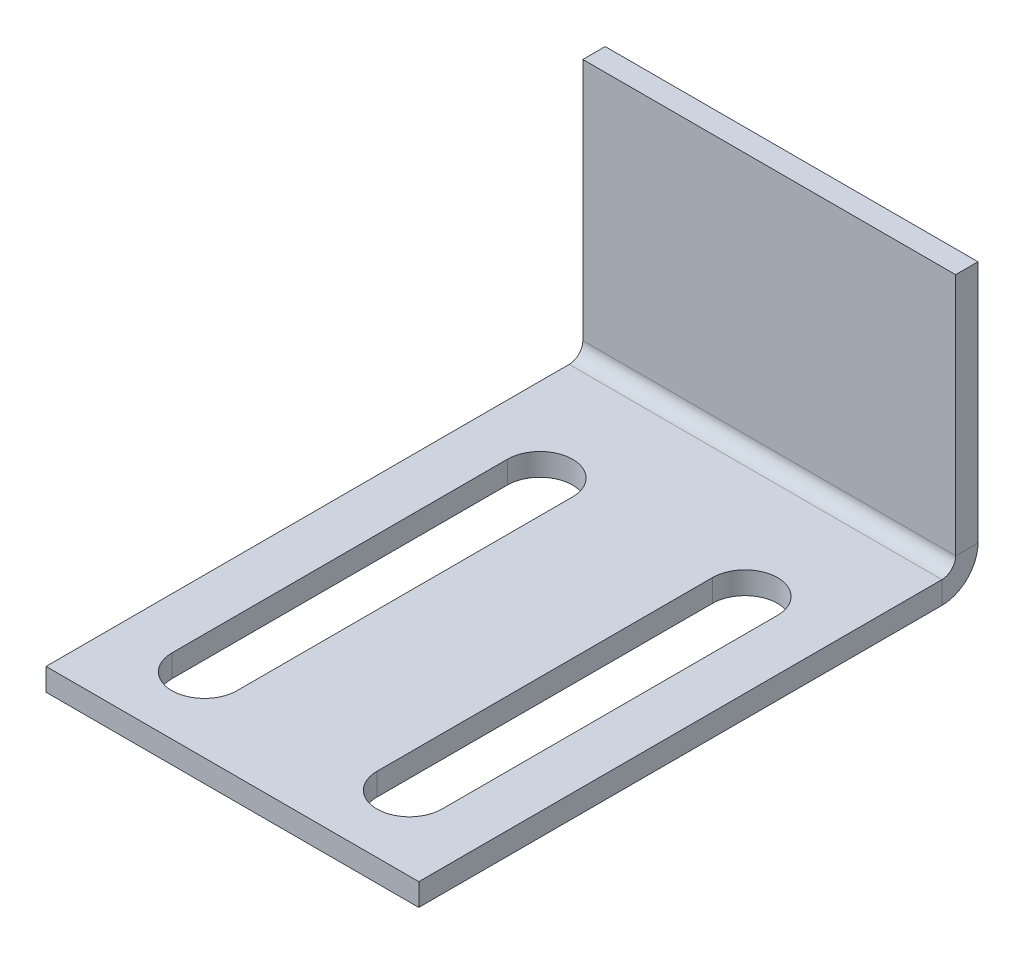
ISO-10303-21;
HEADER;
FILE_DESCRIPTION(('STEP AP214'),'2;1');
FILE_NAME('part.step','',(''),(''),'','','');
FILE_SCHEMA(('AUTOMOTIVE_DESIGN { 1 0 10303 214 1 1 1 1 }'));
ENDSEC;
DATA;
#1=APPLICATION_CONTEXT('core data for automotive mechanical design processes');
#2=APPLICATION_PROTOCOL_DEFINITION('international standard','automotive_design',2000,#1);
#3=PRODUCT_CONTEXT('',#1,'mechanical');
#4=PRODUCT('Part','Part','',(#3));
#5=PRODUCT_RELATED_PRODUCT_CATEGORY('part','',(#4));
#6=PRODUCT_DEFINITION_FORMATION('','',#4);
#7=PRODUCT_DEFINITION_CONTEXT('part definition',#1,'design');
#8=PRODUCT_DEFINITION('design','',#6,#7);
#9=PRODUCT_DEFINITION_SHAPE('','',#8);
#10=(LENGTH_UNIT() NAMED_UNIT(*) SI_UNIT(.MILLI.,.METRE.));
#11=(NAMED_UNIT(*) PLANE_ANGLE_UNIT() SI_UNIT($,.RADIAN.));
#12=(NAMED_UNIT(*) SI_UNIT($,.STERADIAN.) SOLID_ANGLE_UNIT());
#13=UNCERTAINTY_MEASURE_WITH_UNIT(LENGTH_MEASURE(1.E-05),#10,'distance_accuracy_value','');
#14=(GEOMETRIC_REPRESENTATION_CONTEXT(3) GLOBAL_UNCERTAINTY_ASSIGNED_CONTEXT((#13)) GLOBAL_UNIT_ASSIGNED_CONTEXT((#10,
#11,#12)) REPRESENTATION_CONTEXT('',''));
#15=CARTESIAN_POINT('',(0.,0.,0.));
#16=DIRECTION('',(0.,0.,1.));
#17=DIRECTION('',(1.,0.,0.));
#18=AXIS2_PLACEMENT_3D('',#15,#16,#17);
#19=CARTESIAN_POINT('',(20.,0.,-1.2));
#20=DIRECTION('',(1.,0.,0.));
#21=DIRECTION('',(0.,0.,-1.));
#22=AXIS2_PLACEMENT_3D('',#19,#20,#21);
#23=PLANE('',#22);
#24=DIRECTION('',(0.,1.,0.));
#25=VECTOR('',#24,1.);
#26=CARTESIAN_POINT('',(20.,0.,0.));
#27=LINE('',#26,#25);
#28=CARTESIAN_POINT('',(20.,1.9366,0.));
#29=VERTEX_POINT('',#28);
#30=CARTESIAN_POINT('',(20.,15.,0.));
#31=VERTEX_POINT('',#30);
#32=EDGE_CURVE('E302',#29,#31,#27,.T.);
#33=ORIENTED_EDGE('',*,*,#32,.F.);
#34=DIRECTION('',(0.,0.,-1.));
#35=VECTOR('',#34,1.);
#36=CARTESIAN_POINT('',(20.,1.9366,0.));
#37=LINE('',#36,#35);
#38=CARTESIAN_POINT('',(20.,1.9366,-1.2));
#39=VERTEX_POINT('',#38);
#40=EDGE_CURVE('E275',#29,#39,#37,.T.);
#41=ORIENTED_EDGE('',*,*,#40,.T.);
#42=DIRECTION('',(0.,1.,0.));
#43=VECTOR('',#42,1.);
#44=CARTESIAN_POINT('',(20.,0.,-1.2));
#45=LINE('',#44,#43);
#46=CARTESIAN_POINT('',(20.,15.,-1.2));
#47=VERTEX_POINT('',#46);
#48=EDGE_CURVE('E294',#39,#47,#45,.T.);
#49=ORIENTED_EDGE('',*,*,#48,.T.);
#50=DIRECTION('',(0.,0.,1.));
#51=VECTOR('',#50,1.);
#52=CARTESIAN_POINT('',(20.,15.,-1.2));
#53=LINE('',#52,#51);
#54=EDGE_CURVE('E62',#47,#31,#53,.T.);
#55=ORIENTED_EDGE('',*,*,#54,.T.);
#56=EDGE_LOOP('',(#33,#41,#49,#55));
#57=FACE_BOUND('',#56,.T.);
#58=ADVANCED_FACE('F58',(#57),#23,.T.);
#59=CARTESIAN_POINT('',(0.,0.,-1.2));
#60=DIRECTION('',(0.,0.,-1.));
#61=DIRECTION('',(-1.,0.,0.));
#62=AXIS2_PLACEMENT_3D('',#59,#60,#61);
#63=PLANE('',#62);
#64=ORIENTED_EDGE('',*,*,#48,.F.);
#65=DIRECTION('',(1.,0.,0.));
#66=VECTOR('',#65,1.);
#67=CARTESIAN_POINT('',(20.,1.93659999999999,-1.2));
#68=LINE('',#67,#66);
#69=CARTESIAN_POINT('',(0.,1.9366,-1.2));
#70=VERTEX_POINT('',#69);
#71=EDGE_CURVE('E268',#39,#70,#68,.F.);
#72=ORIENTED_EDGE('',*,*,#71,.T.);
#73=DIRECTION('',(0.,-1.,0.));
#74=VECTOR('',#73,1.);
#75=CARTESIAN_POINT('',(0.,0.,-1.2));
#76=LINE('',#75,#74);
#77=CARTESIAN_POINT('',(0.,15.,-1.2));
#78=VERTEX_POINT('',#77);
#79=EDGE_CURVE('E291',#78,#70,#76,.T.);
#80=ORIENTED_EDGE('',*,*,#79,.F.);
#81=DIRECTION('',(-1.,0.,0.));
#82=VECTOR('',#81,1.);
#83=CARTESIAN_POINT('',(0.,15.,-1.2));
#84=LINE('',#83,#82);
#85=EDGE_CURVE('E297',#47,#78,#84,.T.);
#86=ORIENTED_EDGE('',*,*,#85,.F.);
#87=EDGE_LOOP('',(#64,#72,#80,#86));
#88=FACE_BOUND('',#87,.T.);
#89=ADVANCED_FACE('F324',(#88),#63,.T.);
#90=CARTESIAN_POINT('',(0.,0.,0.));
#91=DIRECTION('',(0.,0.,-1.));
#92=DIRECTION('',(-1.,0.,0.));
#93=AXIS2_PLACEMENT_3D('',#90,#91,#92);
#94=PLANE('',#93);
#95=DIRECTION('',(1.,0.,0.));
#96=VECTOR('',#95,1.);
#97=CARTESIAN_POINT('',(20.,1.9366,0.));
#98=LINE('',#97,#96);
#99=CARTESIAN_POINT('',(0.,1.93659999999999,0.));
#100=VERTEX_POINT('',#99);
#101=EDGE_CURVE('E281',#29,#100,#98,.F.);
#102=ORIENTED_EDGE('',*,*,#101,.F.);
#103=ORIENTED_EDGE('',*,*,#32,.T.);
#104=DIRECTION('',(-1.,0.,0.));
#105=VECTOR('',#104,1.);
#106=CARTESIAN_POINT('',(0.,15.,0.));
#107=LINE('',#106,#105);
#108=CARTESIAN_POINT('',(0.,15.,0.));
#109=VERTEX_POINT('',#108);
#110=EDGE_CURVE('E295',#31,#109,#107,.T.);
#111=ORIENTED_EDGE('',*,*,#110,.T.);
#112=DIRECTION('',(0.,-1.,0.));
#113=VECTOR('',#112,1.);
#114=CARTESIAN_POINT('',(0.,0.,0.));
#115=LINE('',#114,#113);
#116=EDGE_CURVE('E288',#109,#100,#115,.T.);
#117=ORIENTED_EDGE('',*,*,#116,.T.);
#118=EDGE_LOOP('',(#102,#103,#111,#117));
#119=FACE_BOUND('',#118,.T.);
#120=ADVANCED_FACE('F308',(#119),#94,.F.);
#121=CARTESIAN_POINT('',(0.,0.,-1.2));
#122=DIRECTION('',(-1.,0.,0.));
#123=DIRECTION('',(0.,0.,1.));
#124=AXIS2_PLACEMENT_3D('',#121,#122,#123);
#125=PLANE('',#124);
#126=DIRECTION('',(0.,0.,-1.));
#127=VECTOR('',#126,1.);
#128=CARTESIAN_POINT('',(0.,1.93659999999999,0.));
#129=LINE('',#128,#127);
#130=EDGE_CURVE('E285',#100,#70,#129,.T.);
#131=ORIENTED_EDGE('',*,*,#130,.F.);
#132=ORIENTED_EDGE('',*,*,#116,.F.);
#133=DIRECTION('',(0.,0.,1.));
#134=VECTOR('',#133,1.);
#135=CARTESIAN_POINT('',(0.,15.,-1.2));
#136=LINE('',#135,#134);
#137=EDGE_CURVE('E13',#78,#109,#136,.T.);
#138=ORIENTED_EDGE('',*,*,#137,.F.);
#139=ORIENTED_EDGE('',*,*,#79,.T.);
#140=EDGE_LOOP('',(#131,#132,#138,#139));
#141=FACE_BOUND('',#140,.T.);
#142=ADVANCED_FACE('F60',(#141),#125,.T.);
#143=CARTESIAN_POINT('',(0.,15.,-1.2));
#144=DIRECTION('',(0.,1.,0.));
#145=DIRECTION('',(0.,0.,1.));
#146=AXIS2_PLACEMENT_3D('',#143,#144,#145);
#147=PLANE('',#146);
#148=ORIENTED_EDGE('',*,*,#110,.F.);
#149=ORIENTED_EDGE('',*,*,#54,.F.);
#150=ORIENTED_EDGE('',*,*,#85,.T.);
#151=ORIENTED_EDGE('',*,*,#137,.T.);
#152=EDGE_LOOP('',(#148,#149,#150,#151));
#153=FACE_BOUND('',#152,.T.);
#154=ADVANCED_FACE('F315',(#153),#147,.T.);
#155=CARTESIAN_POINT('',(0.,1.9366,0.7366));
#156=DIRECTION('',(-1.,0.,0.));
#157=DIRECTION('',(0.,-1.,0.));
#158=AXIS2_PLACEMENT_3D('',#155,#156,#157);
#159=PLANE('',#158);
#160=DIRECTION('',(0.,1.,0.));
#161=VECTOR('',#160,1.);
#162=CARTESIAN_POINT('',(0.,0.,0.736599999999993));
#163=LINE('',#162,#161);
#164=CARTESIAN_POINT('',(0.,1.2,0.736599999999997));
#165=VERTEX_POINT('',#164);
#166=CARTESIAN_POINT('',(0.,0.,0.736599999999993));
#167=VERTEX_POINT('',#166);
#168=EDGE_CURVE('E237',#165,#167,#163,.F.);
#169=ORIENTED_EDGE('',*,*,#168,.F.);
#170=CARTESIAN_POINT('',(0.,1.9366,0.7366));
#171=DIRECTION('',(1.,0.,0.));
#172=DIRECTION('',(0.,1.,0.));
#173=AXIS2_PLACEMENT_3D('',#170,#171,#172);
#174=CIRCLE('',#173,0.736599999999998);
#175=EDGE_CURVE('E278',#100,#165,#174,.F.);
#176=ORIENTED_EDGE('',*,*,#175,.F.);
#177=ORIENTED_EDGE('',*,*,#130,.T.);
#178=CARTESIAN_POINT('',(0.,1.9366,0.7366));
#179=DIRECTION('',(1.,0.,0.));
#180=DIRECTION('',(0.,1.,0.));
#181=AXIS2_PLACEMENT_3D('',#178,#179,#180);
#182=CIRCLE('',#181,1.9366);
#183=EDGE_CURVE('E271',#70,#167,#182,.F.);
#184=ORIENTED_EDGE('',*,*,#183,.T.);
#185=EDGE_LOOP('',(#169,#176,#177,#184));
#186=FACE_BOUND('',#185,.T.);
#187=ADVANCED_FACE('F321',(#186),#159,.T.);
#188=CARTESIAN_POINT('',(20.,1.9366,0.7366));
#189=DIRECTION('',(-1.,0.,0.));
#190=DIRECTION('',(0.,-1.,0.));
#191=AXIS2_PLACEMENT_3D('',#188,#189,#190);
#192=PLANE('',#191);
#193=CARTESIAN_POINT('',(20.,1.9366,0.7366));
#194=DIRECTION('',(1.,0.,0.));
#195=DIRECTION('',(0.,1.,0.));
#196=AXIS2_PLACEMENT_3D('',#193,#194,#195);
#197=CIRCLE('',#196,0.736599999999998);
#198=CARTESIAN_POINT('',(20.,1.2,0.736599999999997));
#199=VERTEX_POINT('',#198);
#200=EDGE_CURVE('E241',#199,#29,#197,.T.);
#201=ORIENTED_EDGE('',*,*,#200,.F.);
#202=DIRECTION('',(0.,1.,0.));
#203=VECTOR('',#202,1.);
#204=CARTESIAN_POINT('',(20.,1.2,0.736599999999997));
#205=LINE('',#204,#203);
#206=CARTESIAN_POINT('',(20.,0.,0.736599999999993));
#207=VERTEX_POINT('',#206);
#208=EDGE_CURVE('E261',#199,#207,#205,.F.);
#209=ORIENTED_EDGE('',*,*,#208,.T.);
#210=CARTESIAN_POINT('',(20.,1.9366,0.7366));
#211=DIRECTION('',(1.,0.,0.));
#212=DIRECTION('',(0.,1.,0.));
#213=AXIS2_PLACEMENT_3D('',#210,#211,#212);
#214=CIRCLE('',#213,1.9366);
#215=EDGE_CURVE('E272',#207,#39,#214,.T.);
#216=ORIENTED_EDGE('',*,*,#215,.T.);
#217=ORIENTED_EDGE('',*,*,#40,.F.);
#218=EDGE_LOOP('',(#201,#209,#216,#217));
#219=FACE_BOUND('',#218,.T.);
#220=ADVANCED_FACE('F329',(#219),#192,.F.);
#221=CARTESIAN_POINT('',(20.,1.9366,0.7366));
#222=DIRECTION('',(1.,0.,0.));
#223=DIRECTION('',(0.,-1.,0.));
#224=AXIS2_PLACEMENT_3D('',#221,#222,#223);
#225=CYLINDRICAL_SURFACE('',#224,1.9366);
#226=ORIENTED_EDGE('',*,*,#71,.F.);
#227=ORIENTED_EDGE('',*,*,#215,.F.);
#228=DIRECTION('',(1.,0.,0.));
#229=VECTOR('',#228,1.);
#230=CARTESIAN_POINT('',(0.,0.,0.736599999999993));
#231=LINE('',#230,#229);
#232=EDGE_CURVE('E259',#207,#167,#231,.F.);
#233=ORIENTED_EDGE('',*,*,#232,.T.);
#234=ORIENTED_EDGE('',*,*,#183,.F.);
#235=EDGE_LOOP('',(#226,#227,#233,#234));
#236=FACE_BOUND('',#235,.T.);
#237=ADVANCED_FACE('F326',(#236),#225,.T.);
#238=CARTESIAN_POINT('',(20.,1.9366,0.7366));
#239=DIRECTION('',(1.,0.,0.));
#240=DIRECTION('',(0.,-1.,0.));
#241=AXIS2_PLACEMENT_3D('',#238,#239,#240);
#242=CYLINDRICAL_SURFACE('',#241,0.736599999999998);
#243=ORIENTED_EDGE('',*,*,#101,.T.);
#244=ORIENTED_EDGE('',*,*,#175,.T.);
#245=DIRECTION('',(1.,0.,0.));
#246=VECTOR('',#245,1.);
#247=CARTESIAN_POINT('',(0.,1.2,0.736599999999997));
#248=LINE('',#247,#246);
#249=EDGE_CURVE('E264',#165,#199,#248,.T.);
#250=ORIENTED_EDGE('',*,*,#249,.T.);
#251=ORIENTED_EDGE('',*,*,#200,.T.);
#252=EDGE_LOOP('',(#243,#244,#250,#251));
#253=FACE_BOUND('',#252,.T.);
#254=ADVANCED_FACE('F347',(#253),#242,.F.);
#255=CARTESIAN_POINT('',(0.,0.,0.));
#256=DIRECTION('',(1.,0.,0.));
#257=DIRECTION('',(0.,0.,-1.));
#258=AXIS2_PLACEMENT_3D('',#255,#256,#257);
#259=PLANE('',#258);
#260=ORIENTED_EDGE('',*,*,#168,.T.);
#261=DIRECTION('',(0.,0.,-1.));
#262=VECTOR('',#261,1.);
#263=CARTESIAN_POINT('',(0.,0.,0.));
#264=LINE('',#263,#262);
#265=CARTESIAN_POINT('',(0.,-1.00554662558682E-13,28.8));
#266=VERTEX_POINT('',#265);
#267=EDGE_CURVE('E249',#266,#167,#264,.T.);
#268=ORIENTED_EDGE('',*,*,#267,.F.);
#269=DIRECTION('',(0.,1.,0.));
#270=VECTOR('',#269,1.);
#271=CARTESIAN_POINT('',(0.,-1.00554662558682E-13,28.8));
#272=LINE('',#271,#270);
#273=CARTESIAN_POINT('',(0.,1.1999999999999,28.8));
#274=VERTEX_POINT('',#273);
#275=EDGE_CURVE('E242',#266,#274,#272,.T.);
#276=ORIENTED_EDGE('',*,*,#275,.T.);
#277=DIRECTION('',(0.,0.,1.));
#278=VECTOR('',#277,1.);
#279=CARTESIAN_POINT('',(0.,1.2,0.));
#280=LINE('',#279,#278);
#281=EDGE_CURVE('E256',#274,#165,#280,.F.);
#282=ORIENTED_EDGE('',*,*,#281,.T.);
#283=EDGE_LOOP('',(#260,#268,#276,#282));
#284=FACE_BOUND('',#283,.T.);
#285=ADVANCED_FACE('F350',(#284),#259,.F.);
#286=CARTESIAN_POINT('',(20.,-1.00613961606655E-13,28.8));
#287=DIRECTION('',(-1.,0.,0.));
#288=DIRECTION('',(0.,0.,1.));
#289=AXIS2_PLACEMENT_3D('',#286,#287,#288);
#290=PLANE('',#289);
#291=ORIENTED_EDGE('',*,*,#208,.F.);
#292=DIRECTION('',(0.,0.,-1.));
#293=VECTOR('',#292,1.);
#294=CARTESIAN_POINT('',(20.,1.1999999999999,28.8));
#295=LINE('',#294,#293);
#296=CARTESIAN_POINT('',(20.,1.1999999999999,28.8));
#297=VERTEX_POINT('',#296);
#298=EDGE_CURVE('E254',#199,#297,#295,.F.);
#299=ORIENTED_EDGE('',*,*,#298,.T.);
#300=DIRECTION('',(0.,1.,0.));
#301=VECTOR('',#300,1.);
#302=CARTESIAN_POINT('',(20.,-1.00613961606655E-13,28.8));
#303=LINE('',#302,#301);
#304=CARTESIAN_POINT('',(20.,-1.00554662558682E-13,28.8));
#305=VERTEX_POINT('',#304);
#306=EDGE_CURVE('E238',#305,#297,#303,.T.);
#307=ORIENTED_EDGE('',*,*,#306,.F.);
#308=DIRECTION('',(0.,0.,1.));
#309=VECTOR('',#308,1.);
#310=CARTESIAN_POINT('',(20.,0.,0.));
#311=LINE('',#310,#309);
#312=EDGE_CURVE('E247',#207,#305,#311,.T.);
#313=ORIENTED_EDGE('',*,*,#312,.F.);
#314=EDGE_LOOP('',(#291,#299,#307,#313));
#315=FACE_BOUND('',#314,.T.);
#316=ADVANCED_FACE('F356',(#315),#290,.F.);
#317=CARTESIAN_POINT('',(0.,0.,0.));
#318=DIRECTION('',(0.,1.,0.));
#319=DIRECTION('',(0.,0.,1.));
#320=AXIS2_PLACEMENT_3D('',#317,#318,#319);
#321=PLANE('',#320);
#322=DIRECTION('',(0.,0.,1.));
#323=VECTOR('',#322,1.);
#324=CARTESIAN_POINT('',(17.25,0.,6.8));
#325=LINE('',#324,#323);
#326=CARTESIAN_POINT('',(17.25,0.,6.8));
#327=VERTEX_POINT('',#326);
#328=CARTESIAN_POINT('',(17.25,0.,24.8));
#329=VERTEX_POINT('',#328);
#330=EDGE_CURVE('E190',#327,#329,#325,.T.);
#331=ORIENTED_EDGE('',*,*,#330,.F.);
#332=CARTESIAN_POINT('',(15.5,0.,6.8));
#333=DIRECTION('',(0.,1.,0.));
#334=DIRECTION('',(0.,0.,1.));
#335=AXIS2_PLACEMENT_3D('',#332,#333,#334);
#336=CIRCLE('',#335,1.75);
#337=CARTESIAN_POINT('',(13.75,0.,6.8));
#338=VERTEX_POINT('',#337);
#339=EDGE_CURVE('E172',#338,#327,#336,.F.);
#340=ORIENTED_EDGE('',*,*,#339,.F.);
#341=DIRECTION('',(0.,0.,-1.));
#342=VECTOR('',#341,1.);
#343=CARTESIAN_POINT('',(13.75,0.,6.8));
#344=LINE('',#343,#342);
#345=CARTESIAN_POINT('',(13.75,0.,24.8));
#346=VERTEX_POINT('',#345);
#347=EDGE_CURVE('E181',#346,#338,#344,.T.);
#348=ORIENTED_EDGE('',*,*,#347,.F.);
#349=CARTESIAN_POINT('',(15.5,0.,24.8));
#350=DIRECTION('',(0.,1.,0.));
#351=DIRECTION('',(0.,0.,1.));
#352=AXIS2_PLACEMENT_3D('',#349,#350,#351);
#353=CIRCLE('',#352,1.75000000000001);
#354=EDGE_CURVE('E73',#329,#346,#353,.F.);
#355=ORIENTED_EDGE('',*,*,#354,.F.);
#356=EDGE_LOOP('',(#331,#340,#348,#355));
#357=FACE_BOUND('',#356,.T.);
#358=DIRECTION('',(0.,0.,1.));
#359=VECTOR('',#358,1.);
#360=CARTESIAN_POINT('',(6.25,0.,6.8));
#361=LINE('',#360,#359);
#362=CARTESIAN_POINT('',(6.25,0.,6.8));
#363=VERTEX_POINT('',#362);
#364=CARTESIAN_POINT('',(6.25,0.,24.8));
#365=VERTEX_POINT('',#364);
#366=EDGE_CURVE('E208',#363,#365,#361,.T.);
#367=ORIENTED_EDGE('',*,*,#366,.F.);
#368=CARTESIAN_POINT('',(4.5,0.,6.8));
#369=DIRECTION('',(0.,1.,0.));
#370=DIRECTION('',(0.,0.,1.));
#371=AXIS2_PLACEMENT_3D('',#368,#369,#370);
#372=CIRCLE('',#371,1.75);
#373=CARTESIAN_POINT('',(2.75,0.,6.8));
#374=VERTEX_POINT('',#373);
#375=EDGE_CURVE('E211',#374,#363,#372,.F.);
#376=ORIENTED_EDGE('',*,*,#375,.F.);
#377=DIRECTION('',(0.,0.,-1.));
#378=VECTOR('',#377,1.);
#379=CARTESIAN_POINT('',(2.75,0.,6.8));
#380=LINE('',#379,#378);
#381=CARTESIAN_POINT('',(2.74999999999999,0.,24.8));
#382=VERTEX_POINT('',#381);
#383=EDGE_CURVE('E228',#382,#374,#380,.T.);
#384=ORIENTED_EDGE('',*,*,#383,.F.);
#385=CARTESIAN_POINT('',(4.5,0.,24.8));
#386=DIRECTION('',(0.,1.,0.));
#387=DIRECTION('',(0.,0.,1.));
#388=AXIS2_PLACEMENT_3D('',#385,#386,#387);
#389=CIRCLE('',#388,1.75000000000001);
#390=EDGE_CURVE('E184',#365,#382,#389,.F.);
#391=ORIENTED_EDGE('',*,*,#390,.F.);
#392=EDGE_LOOP('',(#367,#376,#384,#391));
#393=FACE_BOUND('',#392,.T.);
#394=ORIENTED_EDGE('',*,*,#232,.F.);
#395=ORIENTED_EDGE('',*,*,#312,.T.);
#396=DIRECTION('',(-1.,0.,0.));
#397=VECTOR('',#396,1.);
#398=CARTESIAN_POINT('',(0.,-1.00554662558682E-13,28.8));
#399=LINE('',#398,#397);
#400=EDGE_CURVE('E245',#305,#266,#399,.T.);
#401=ORIENTED_EDGE('',*,*,#400,.T.);
#402=ORIENTED_EDGE('',*,*,#267,.T.);
#403=EDGE_LOOP('',(#394,#395,#401,#402));
#404=FACE_BOUND('',#403,.T.);
#405=ADVANCED_FACE('F187',(#357,#393,#404),#321,.F.);
#406=CARTESIAN_POINT('',(0.,1.2,0.));
#407=DIRECTION('',(0.,1.,0.));
#408=DIRECTION('',(0.,0.,1.));
#409=AXIS2_PLACEMENT_3D('',#406,#407,#408);
#410=PLANE('',#409);
#411=CARTESIAN_POINT('',(15.5,1.19999999999998,6.80000000000001));
#412=DIRECTION('',(0.,1.,0.));
#413=DIRECTION('',(0.,0.,1.));
#414=AXIS2_PLACEMENT_3D('',#411,#412,#413);
#415=CIRCLE('',#414,1.75);
#416=CARTESIAN_POINT('',(17.25,1.19999999999998,6.80000000000001));
#417=VERTEX_POINT('',#416);
#418=CARTESIAN_POINT('',(13.75,1.19999999999998,6.8));
#419=VERTEX_POINT('',#418);
#420=EDGE_CURVE('E81',#417,#419,#415,.T.);
#421=ORIENTED_EDGE('',*,*,#420,.F.);
#422=DIRECTION('',(0.,0.,-1.));
#423=VECTOR('',#422,1.);
#424=CARTESIAN_POINT('',(17.25,1.19999999999998,6.80000000000001));
#425=LINE('',#424,#423);
#426=CARTESIAN_POINT('',(17.25,1.19999999999991,24.8));
#427=VERTEX_POINT('',#426);
#428=EDGE_CURVE('E178',#427,#417,#425,.T.);
#429=ORIENTED_EDGE('',*,*,#428,.F.);
#430=CARTESIAN_POINT('',(15.5,1.19999999999991,24.8));
#431=DIRECTION('',(0.,1.,0.));
#432=DIRECTION('',(0.,0.,1.));
#433=AXIS2_PLACEMENT_3D('',#430,#431,#432);
#434=CIRCLE('',#433,1.75000000000001);
#435=CARTESIAN_POINT('',(13.75,1.19999999999991,24.8));
#436=VERTEX_POINT('',#435);
#437=EDGE_CURVE('E198',#436,#427,#434,.T.);
#438=ORIENTED_EDGE('',*,*,#437,.F.);
#439=DIRECTION('',(0.,0.,1.));
#440=VECTOR('',#439,1.);
#441=CARTESIAN_POINT('',(13.75,1.19999999999998,6.80000000000001));
#442=LINE('',#441,#440);
#443=EDGE_CURVE('E192',#419,#436,#442,.T.);
#444=ORIENTED_EDGE('',*,*,#443,.F.);
#445=EDGE_LOOP('',(#421,#429,#438,#444));
#446=FACE_BOUND('',#445,.T.);
#447=CARTESIAN_POINT('',(4.5,1.19999999999998,6.80000000000001));
#448=DIRECTION('',(0.,1.,0.));
#449=DIRECTION('',(0.,0.,1.));
#450=AXIS2_PLACEMENT_3D('',#447,#448,#449);
#451=CIRCLE('',#450,1.75);
#452=CARTESIAN_POINT('',(6.25,1.19999999999998,6.80000000000001));
#453=VERTEX_POINT('',#452);
#454=CARTESIAN_POINT('',(2.75,1.19999999999998,6.8));
#455=VERTEX_POINT('',#454);
#456=EDGE_CURVE('E214',#453,#455,#451,.T.);
#457=ORIENTED_EDGE('',*,*,#456,.F.);
#458=DIRECTION('',(0.,0.,-1.));
#459=VECTOR('',#458,1.);
#460=CARTESIAN_POINT('',(6.25,1.19999999999998,6.80000000000001));
#461=LINE('',#460,#459);
#462=CARTESIAN_POINT('',(6.25,1.19999999999991,24.8));
#463=VERTEX_POINT('',#462);
#464=EDGE_CURVE('E222',#463,#453,#461,.T.);
#465=ORIENTED_EDGE('',*,*,#464,.F.);
#466=CARTESIAN_POINT('',(4.5,1.19999999999991,24.8));
#467=DIRECTION('',(0.,1.,0.));
#468=DIRECTION('',(0.,0.,1.));
#469=AXIS2_PLACEMENT_3D('',#466,#467,#468);
#470=CIRCLE('',#469,1.75000000000001);
#471=CARTESIAN_POINT('',(2.74999999999999,1.19999999999991,24.8));
#472=VERTEX_POINT('',#471);
#473=EDGE_CURVE('E219',#472,#463,#470,.T.);
#474=ORIENTED_EDGE('',*,*,#473,.F.);
#475=DIRECTION('',(0.,0.,1.));
#476=VECTOR('',#475,1.);
#477=CARTESIAN_POINT('',(2.75,1.19999999999998,6.80000000000001));
#478=LINE('',#477,#476);
#479=EDGE_CURVE('E216',#455,#472,#478,.T.);
#480=ORIENTED_EDGE('',*,*,#479,.F.);
#481=EDGE_LOOP('',(#457,#465,#474,#480));
#482=FACE_BOUND('',#481,.T.);
#483=ORIENTED_EDGE('',*,*,#298,.F.);
#484=ORIENTED_EDGE('',*,*,#249,.F.);
#485=ORIENTED_EDGE('',*,*,#281,.F.);
#486=DIRECTION('',(1.,0.,0.));
#487=VECTOR('',#486,1.);
#488=CARTESIAN_POINT('',(0.,1.1999999999999,28.8));
#489=LINE('',#488,#487);
#490=EDGE_CURVE('E252',#297,#274,#489,.F.);
#491=ORIENTED_EDGE('',*,*,#490,.F.);
#492=EDGE_LOOP('',(#483,#484,#485,#491));
#493=FACE_BOUND('',#492,.T.);
#494=ADVANCED_FACE('F365',(#446,#482,#493),#410,.T.);
#495=CARTESIAN_POINT('',(0.,-1.00613961606655E-13,28.8));
#496=DIRECTION('',(0.,0.,-1.));
#497=DIRECTION('',(0.,1.,0.));
#498=AXIS2_PLACEMENT_3D('',#495,#496,#497);
#499=PLANE('',#498);
#500=ORIENTED_EDGE('',*,*,#490,.T.);
#501=ORIENTED_EDGE('',*,*,#275,.F.);
#502=ORIENTED_EDGE('',*,*,#400,.F.);
#503=ORIENTED_EDGE('',*,*,#306,.T.);
#504=EDGE_LOOP('',(#500,#501,#502,#503));
#505=FACE_BOUND('',#504,.T.);
#506=ADVANCED_FACE('F361',(#505),#499,.F.);
#507=CARTESIAN_POINT('',(4.5,-0.0010000000001285,6.8));
#508=DIRECTION('',(0.,1.,0.));
#509=DIRECTION('',(0.,0.,1.));
#510=AXIS2_PLACEMENT_3D('',#507,#508,#509);
#511=CYLINDRICAL_SURFACE('',#510,1.75);
#512=ORIENTED_EDGE('',*,*,#375,.T.);
#513=DIRECTION('',(0.,1.,0.));
#514=VECTOR('',#513,1.);
#515=CARTESIAN_POINT('',(6.25,-0.0010000000001285,6.8));
#516=LINE('',#515,#514);
#517=EDGE_CURVE('E226',#363,#453,#516,.T.);
#518=ORIENTED_EDGE('',*,*,#517,.T.);
#519=ORIENTED_EDGE('',*,*,#456,.T.);
#520=DIRECTION('',(0.,1.,0.));
#521=VECTOR('',#520,1.);
#522=CARTESIAN_POINT('',(2.75,-0.0010000000001285,6.8));
#523=LINE('',#522,#521);
#524=EDGE_CURVE('E225',#374,#455,#523,.T.);
#525=ORIENTED_EDGE('',*,*,#524,.F.);
#526=EDGE_LOOP('',(#512,#518,#519,#525));
#527=FACE_BOUND('',#526,.T.);
#528=ADVANCED_FACE('F364',(#527),#511,.F.);
#529=CARTESIAN_POINT('',(6.25,-0.0010000000001285,6.8));
#530=DIRECTION('',(1.,0.,0.));
#531=DIRECTION('',(0.,0.,-1.));
#532=AXIS2_PLACEMENT_3D('',#529,#530,#531);
#533=PLANE('',#532);
#534=ORIENTED_EDGE('',*,*,#366,.T.);
#535=DIRECTION('',(0.,1.,0.));
#536=VECTOR('',#535,1.);
#537=CARTESIAN_POINT('',(6.25,-0.00100000000019139,24.8));
#538=LINE('',#537,#536);
#539=EDGE_CURVE('E229',#365,#463,#538,.T.);
#540=ORIENTED_EDGE('',*,*,#539,.T.);
#541=ORIENTED_EDGE('',*,*,#464,.T.);
#542=ORIENTED_EDGE('',*,*,#517,.F.);
#543=EDGE_LOOP('',(#534,#540,#541,#542));
#544=FACE_BOUND('',#543,.T.);
#545=ADVANCED_FACE('F374',(#544),#533,.F.);
#546=CARTESIAN_POINT('',(4.5,-0.00100000000019139,24.8));
#547=DIRECTION('',(0.,1.,0.));
#548=DIRECTION('',(0.,0.,1.));
#549=AXIS2_PLACEMENT_3D('',#546,#547,#548);
#550=CYLINDRICAL_SURFACE('',#549,1.75000000000001);
#551=ORIENTED_EDGE('',*,*,#390,.T.);
#552=DIRECTION('',(0.,1.,0.));
#553=VECTOR('',#552,1.);
#554=CARTESIAN_POINT('',(2.74999999999999,-0.00100000000019139,24.8));
#555=LINE('',#554,#553);
#556=EDGE_CURVE('E231',#382,#472,#555,.T.);
#557=ORIENTED_EDGE('',*,*,#556,.T.);
#558=ORIENTED_EDGE('',*,*,#473,.T.);
#559=ORIENTED_EDGE('',*,*,#539,.F.);
#560=EDGE_LOOP('',(#551,#557,#558,#559));
#561=FACE_BOUND('',#560,.T.);
#562=ADVANCED_FACE('F379',(#561),#550,.F.);
#563=CARTESIAN_POINT('',(2.75,-0.0010000000001285,6.8));
#564=DIRECTION('',(-1.,0.,0.));
#565=DIRECTION('',(0.,0.,1.));
#566=AXIS2_PLACEMENT_3D('',#563,#564,#565);
#567=PLANE('',#566);
#568=ORIENTED_EDGE('',*,*,#383,.T.);
#569=ORIENTED_EDGE('',*,*,#524,.T.);
#570=ORIENTED_EDGE('',*,*,#479,.T.);
#571=ORIENTED_EDGE('',*,*,#556,.F.);
#572=EDGE_LOOP('',(#568,#569,#570,#571));
#573=FACE_BOUND('',#572,.T.);
#574=ADVANCED_FACE('F376',(#573),#567,.F.);
#575=CARTESIAN_POINT('',(15.5,-0.0010000000001285,6.8));
#576=DIRECTION('',(0.,1.,0.));
#577=DIRECTION('',(0.,0.,1.));
#578=AXIS2_PLACEMENT_3D('',#575,#576,#577);
#579=CYLINDRICAL_SURFACE('',#578,1.75);
#580=ORIENTED_EDGE('',*,*,#339,.T.);
#581=DIRECTION('',(0.,1.,0.));
#582=VECTOR('',#581,1.);
#583=CARTESIAN_POINT('',(17.25,-0.0010000000001285,6.8));
#584=LINE('',#583,#582);
#585=EDGE_CURVE('E185',#327,#417,#584,.T.);
#586=ORIENTED_EDGE('',*,*,#585,.T.);
#587=ORIENTED_EDGE('',*,*,#420,.T.);
#588=DIRECTION('',(0.,1.,0.));
#589=VECTOR('',#588,1.);
#590=CARTESIAN_POINT('',(13.75,-0.0010000000001285,6.8));
#591=LINE('',#590,#589);
#592=EDGE_CURVE('E168',#338,#419,#591,.T.);
#593=ORIENTED_EDGE('',*,*,#592,.F.);
#594=EDGE_LOOP('',(#580,#586,#587,#593));
#595=FACE_BOUND('',#594,.T.);
#596=ADVANCED_FACE('F170',(#595),#579,.F.);
#597=CARTESIAN_POINT('',(17.25,-0.0010000000001285,6.8));
#598=DIRECTION('',(1.,0.,0.));
#599=DIRECTION('',(0.,0.,-1.));
#600=AXIS2_PLACEMENT_3D('',#597,#598,#599);
#601=PLANE('',#600);
#602=ORIENTED_EDGE('',*,*,#330,.T.);
#603=DIRECTION('',(0.,1.,0.));
#604=VECTOR('',#603,1.);
#605=CARTESIAN_POINT('',(17.25,-0.00100000000019139,24.8));
#606=LINE('',#605,#604);
#607=EDGE_CURVE('E204',#329,#427,#606,.T.);
#608=ORIENTED_EDGE('',*,*,#607,.T.);
#609=ORIENTED_EDGE('',*,*,#428,.T.);
#610=ORIENTED_EDGE('',*,*,#585,.F.);
#611=EDGE_LOOP('',(#602,#608,#609,#610));
#612=FACE_BOUND('',#611,.T.);
#613=ADVANCED_FACE('F389',(#612),#601,.F.);
#614=CARTESIAN_POINT('',(15.5,-0.00100000000019139,24.8));
#615=DIRECTION('',(0.,1.,0.));
#616=DIRECTION('',(0.,0.,1.));
#617=AXIS2_PLACEMENT_3D('',#614,#615,#616);
#618=CYLINDRICAL_SURFACE('',#617,1.75000000000001);
#619=ORIENTED_EDGE('',*,*,#354,.T.);
#620=DIRECTION('',(0.,1.,0.));
#621=VECTOR('',#620,1.);
#622=CARTESIAN_POINT('',(13.75,-0.00100000000019139,24.8));
#623=LINE('',#622,#621);
#624=EDGE_CURVE('E177',#346,#436,#623,.T.);
#625=ORIENTED_EDGE('',*,*,#624,.T.);
#626=ORIENTED_EDGE('',*,*,#437,.T.);
#627=ORIENTED_EDGE('',*,*,#607,.F.);
#628=EDGE_LOOP('',(#619,#625,#626,#627));
#629=FACE_BOUND('',#628,.T.);
#630=ADVANCED_FACE('F392',(#629),#618,.F.);
#631=CARTESIAN_POINT('',(13.75,-0.0010000000001285,6.8));
#632=DIRECTION('',(-1.,0.,0.));
#633=DIRECTION('',(0.,0.,1.));
#634=AXIS2_PLACEMENT_3D('',#631,#632,#633);
#635=PLANE('',#634);
#636=ORIENTED_EDGE('',*,*,#347,.T.);
#637=ORIENTED_EDGE('',*,*,#592,.T.);
#638=ORIENTED_EDGE('',*,*,#443,.T.);
#639=ORIENTED_EDGE('',*,*,#624,.F.);
#640=EDGE_LOOP('',(#636,#637,#638,#639));
#641=FACE_BOUND('',#640,.T.);
#642=ADVANCED_FACE('F182',(#641),#635,.F.);
#643=CLOSED_SHELL('',(#58,#89,#120,#142,#154,#187,#220,#237,#254,#285,#316,#405,#494,#506,#528,
#545,#562,#574,#596,#613,#630,#642));
#644=MANIFOLD_SOLID_BREP('B2',#643);
#645=ADVANCED_BREP_SHAPE_REPRESENTATION('',(#18,#644),#14);
#646=SHAPE_DEFINITION_REPRESENTATION(#9,#645);
ENDSEC;
END-ISO-10303-21;
